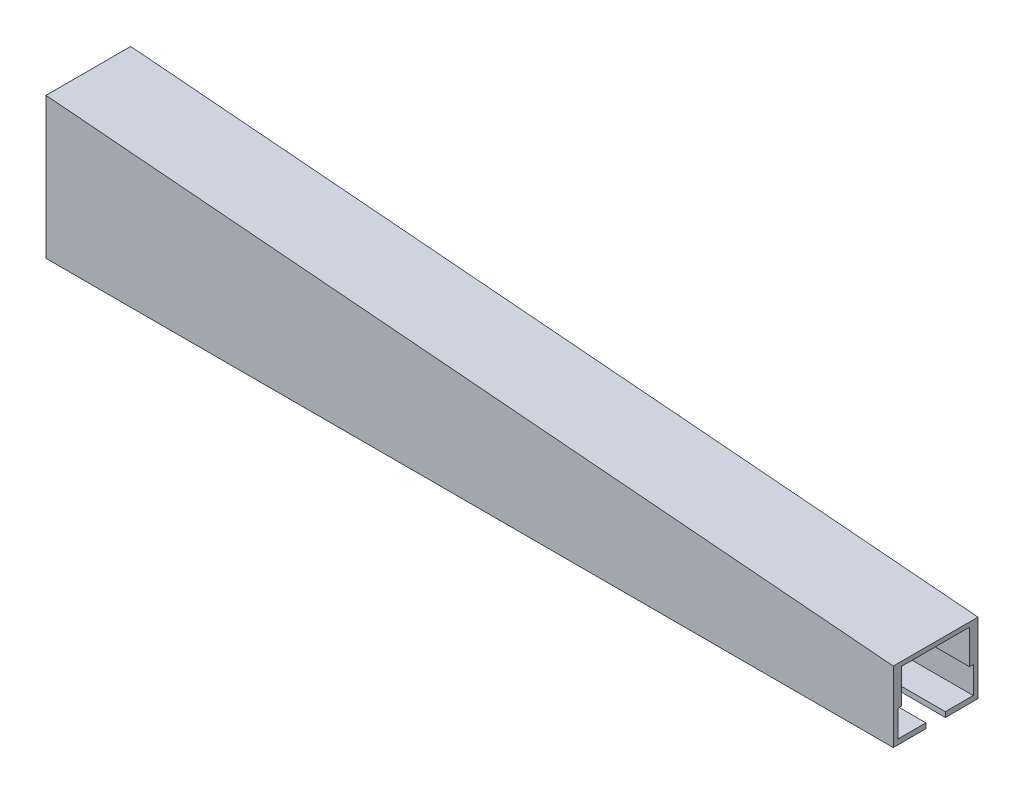
ISO-10303-21;
HEADER;
FILE_DESCRIPTION(('STEP AP214'),'2;1');
FILE_NAME('part.step','',(''),(''),'','','');
FILE_SCHEMA(('AUTOMOTIVE_DESIGN { 1 0 10303 214 1 1 1 1 }'));
ENDSEC;
DATA;
#1=APPLICATION_CONTEXT('core data for automotive mechanical design processes');
#2=APPLICATION_PROTOCOL_DEFINITION('international standard','automotive_design',2000,#1);
#3=PRODUCT_CONTEXT('',#1,'mechanical');
#4=PRODUCT('Part','Part','',(#3));
#5=PRODUCT_RELATED_PRODUCT_CATEGORY('part','',(#4));
#6=PRODUCT_DEFINITION_FORMATION('','',#4);
#7=PRODUCT_DEFINITION_CONTEXT('part definition',#1,'design');
#8=PRODUCT_DEFINITION('design','',#6,#7);
#9=PRODUCT_DEFINITION_SHAPE('','',#8);
#10=(LENGTH_UNIT() NAMED_UNIT(*) SI_UNIT(.MILLI.,.METRE.));
#11=(NAMED_UNIT(*) PLANE_ANGLE_UNIT() SI_UNIT($,.RADIAN.));
#12=(NAMED_UNIT(*) SI_UNIT($,.STERADIAN.) SOLID_ANGLE_UNIT());
#13=UNCERTAINTY_MEASURE_WITH_UNIT(LENGTH_MEASURE(1.E-05),#10,'distance_accuracy_value','');
#14=(GEOMETRIC_REPRESENTATION_CONTEXT(3) GLOBAL_UNCERTAINTY_ASSIGNED_CONTEXT((#13)) GLOBAL_UNIT_ASSIGNED_CONTEXT((#10,
#11,#12)) REPRESENTATION_CONTEXT('',''));
#15=CARTESIAN_POINT('',(0.,0.,0.));
#16=DIRECTION('',(0.,0.,1.));
#17=DIRECTION('',(1.,0.,0.));
#18=AXIS2_PLACEMENT_3D('',#15,#16,#17);
#19=CARTESIAN_POINT('',(0.,11.2975004120288,28.3233824548473));
#20=DIRECTION('',(0.,1.,0.));
#21=DIRECTION('',(0.,0.,1.));
#22=AXIS2_PLACEMENT_3D('',#19,#20,#21);
#23=PLANE('',#22);
#24=DIRECTION('',(-1.,0.,0.));
#25=VECTOR('',#24,1.);
#26=CARTESIAN_POINT('',(0.,11.2975004120288,27.));
#27=LINE('',#26,#25);
#28=CARTESIAN_POINT('',(300.,11.2975004120288,27.));
#29=VERTEX_POINT('',#28);
#30=CARTESIAN_POINT('',(0.,11.2975004120288,27.));
#31=VERTEX_POINT('',#30);
#32=EDGE_CURVE('E45',#29,#31,#27,.T.);
#33=ORIENTED_EDGE('',*,*,#32,.F.);
#34=DIRECTION('',(0.,0.,1.));
#35=VECTOR('',#34,1.);
#36=CARTESIAN_POINT('',(300.,11.2975004120288,28.3233824548473));
#37=LINE('',#36,#35);
#38=CARTESIAN_POINT('',(300.,11.2975004120288,28.3233824548473));
#39=VERTEX_POINT('',#38);
#40=EDGE_CURVE('E204',#29,#39,#37,.T.);
#41=ORIENTED_EDGE('',*,*,#40,.T.);
#42=DIRECTION('',(1.,0.,0.));
#43=VECTOR('',#42,1.);
#44=CARTESIAN_POINT('',(0.,11.2975004120288,28.3233824548473));
#45=LINE('',#44,#43);
#46=CARTESIAN_POINT('',(0.,11.2975004120288,28.3233824548473));
#47=VERTEX_POINT('',#46);
#48=EDGE_CURVE('E223',#47,#39,#45,.T.);
#49=ORIENTED_EDGE('',*,*,#48,.F.);
#50=DIRECTION('',(0.,0.,1.));
#51=VECTOR('',#50,1.);
#52=CARTESIAN_POINT('',(0.,11.2975004120288,28.3233824548473));
#53=LINE('',#52,#51);
#54=EDGE_CURVE('E187',#31,#47,#53,.T.);
#55=ORIENTED_EDGE('',*,*,#54,.F.);
#56=EDGE_LOOP('',(#33,#41,#49,#55));
#57=FACE_BOUND('',#56,.T.);
#58=ADVANCED_FACE('F37',(#57),#23,.F.);
#59=CARTESIAN_POINT('',(0.,0.,30.));
#60=DIRECTION('',(0.,1.,0.));
#61=DIRECTION('',(0.,0.,1.));
#62=AXIS2_PLACEMENT_3D('',#59,#60,#61);
#63=PLANE('',#62);
#64=DIRECTION('',(0.,0.,-1.));
#65=VECTOR('',#64,1.);
#66=CARTESIAN_POINT('',(0.,0.,30.));
#67=LINE('',#66,#65);
#68=CARTESIAN_POINT('',(0.,0.,30.));
#69=VERTEX_POINT('',#68);
#70=CARTESIAN_POINT('',(0.,0.,18.429564860976));
#71=VERTEX_POINT('',#70);
#72=EDGE_CURVE('E262',#69,#71,#67,.T.);
#73=ORIENTED_EDGE('',*,*,#72,.T.);
#74=DIRECTION('',(1.,0.,0.));
#75=VECTOR('',#74,1.);
#76=CARTESIAN_POINT('',(0.,0.,18.429564860976));
#77=LINE('',#76,#75);
#78=CARTESIAN_POINT('',(300.,0.,18.429564860976));
#79=VERTEX_POINT('',#78);
#80=EDGE_CURVE('E215',#71,#79,#77,.T.);
#81=ORIENTED_EDGE('',*,*,#80,.T.);
#82=DIRECTION('',(0.,0.,-1.));
#83=VECTOR('',#82,1.);
#84=CARTESIAN_POINT('',(300.,0.,30.));
#85=LINE('',#84,#83);
#86=CARTESIAN_POINT('',(300.,0.,30.));
#87=VERTEX_POINT('',#86);
#88=EDGE_CURVE('E258',#87,#79,#85,.T.);
#89=ORIENTED_EDGE('',*,*,#88,.F.);
#90=DIRECTION('',(1.,0.,0.));
#91=VECTOR('',#90,1.);
#92=CARTESIAN_POINT('',(0.,0.,30.));
#93=LINE('',#92,#91);
#94=EDGE_CURVE('E236',#69,#87,#93,.T.);
#95=ORIENTED_EDGE('',*,*,#94,.F.);
#96=EDGE_LOOP('',(#73,#81,#89,#95));
#97=FACE_BOUND('',#96,.T.);
#98=ADVANCED_FACE('F321',(#97),#63,.F.);
#99=CARTESIAN_POINT('',(0.,50.,30.));
#100=DIRECTION('',(1.,0.,0.));
#101=DIRECTION('',(0.,1.,0.));
#102=AXIS2_PLACEMENT_3D('',#99,#100,#101);
#103=PLANE('',#102);
#104=CARTESIAN_POINT('',(0.,11.2975004120288,1.67661754515275));
#105=VERTEX_POINT('',#104);
#106=CARTESIAN_POINT('',(0.,11.2975004120288,3.));
#107=VERTEX_POINT('',#106);
#108=EDGE_CURVE('E188',#105,#107,#53,.T.);
#109=ORIENTED_EDGE('',*,*,#108,.T.);
#110=DIRECTION('',(0.,1.,0.));
#111=VECTOR('',#110,1.);
#112=CARTESIAN_POINT('',(0.,7.80839748179973,3.));
#113=LINE('',#112,#111);
#114=CARTESIAN_POINT('',(0.,47.5500240823146,3.));
#115=VERTEX_POINT('',#114);
#116=EDGE_CURVE('E168',#107,#115,#113,.T.);
#117=ORIENTED_EDGE('',*,*,#116,.T.);
#118=DIRECTION('',(0.,0.,1.));
#119=VECTOR('',#118,1.);
#120=CARTESIAN_POINT('',(0.,47.5500240823146,3.));
#121=LINE('',#120,#119);
#122=CARTESIAN_POINT('',(0.,47.5500240823146,27.));
#123=VERTEX_POINT('',#122);
#124=EDGE_CURVE('E160',#115,#123,#121,.T.);
#125=ORIENTED_EDGE('',*,*,#124,.T.);
#126=DIRECTION('',(0.,1.,0.));
#127=VECTOR('',#126,1.);
#128=CARTESIAN_POINT('',(0.,7.80839748179973,27.));
#129=LINE('',#128,#127);
#130=EDGE_CURVE('E150',#31,#123,#129,.T.);
#131=ORIENTED_EDGE('',*,*,#130,.F.);
#132=ORIENTED_EDGE('',*,*,#54,.T.);
#133=DIRECTION('',(0.,-1.,0.));
#134=VECTOR('',#133,1.);
#135=CARTESIAN_POINT('',(0.,1.79768440375418,28.3233824548473));
#136=LINE('',#135,#134);
#137=CARTESIAN_POINT('',(0.,1.79768440375418,28.3233824548473));
#138=VERTEX_POINT('',#137);
#139=EDGE_CURVE('E190',#47,#138,#136,.T.);
#140=ORIENTED_EDGE('',*,*,#139,.T.);
#141=DIRECTION('',(0.,0.,-1.));
#142=VECTOR('',#141,1.);
#143=CARTESIAN_POINT('',(0.,1.79768440375418,18.429564860976));
#144=LINE('',#143,#142);
#145=CARTESIAN_POINT('',(0.,1.79768440375418,18.429564860976));
#146=VERTEX_POINT('',#145);
#147=EDGE_CURVE('E193',#138,#146,#144,.T.);
#148=ORIENTED_EDGE('',*,*,#147,.T.);
#149=DIRECTION('',(0.,-1.,0.));
#150=VECTOR('',#149,1.);
#151=CARTESIAN_POINT('',(0.,0.,18.429564860976));
#152=LINE('',#151,#150);
#153=EDGE_CURVE('E196',#146,#71,#152,.T.);
#154=ORIENTED_EDGE('',*,*,#153,.T.);
#155=ORIENTED_EDGE('',*,*,#72,.F.);
#156=DIRECTION('',(0.,-1.,0.));
#157=VECTOR('',#156,1.);
#158=CARTESIAN_POINT('',(0.,50.,30.));
#159=LINE('',#158,#157);
#160=CARTESIAN_POINT('',(0.,50.,30.));
#161=VERTEX_POINT('',#160);
#162=EDGE_CURVE('E233',#161,#69,#159,.T.);
#163=ORIENTED_EDGE('',*,*,#162,.F.);
#164=DIRECTION('',(0.,0.,-1.));
#165=VECTOR('',#164,1.);
#166=CARTESIAN_POINT('',(0.,50.,30.));
#167=LINE('',#166,#165);
#168=CARTESIAN_POINT('',(0.,50.,0.));
#169=VERTEX_POINT('',#168);
#170=EDGE_CURVE('E243',#161,#169,#167,.T.);
#171=ORIENTED_EDGE('',*,*,#170,.T.);
#172=DIRECTION('',(0.,-1.,0.));
#173=VECTOR('',#172,1.);
#174=CARTESIAN_POINT('',(0.,50.,0.));
#175=LINE('',#174,#173);
#176=CARTESIAN_POINT('',(0.,0.,0.));
#177=VERTEX_POINT('',#176);
#178=EDGE_CURVE('E218',#169,#177,#175,.T.);
#179=ORIENTED_EDGE('',*,*,#178,.T.);
#180=CARTESIAN_POINT('',(0.,0.,11.570435139024));
#181=VERTEX_POINT('',#180);
#182=EDGE_CURVE('E261',#181,#177,#67,.T.);
#183=ORIENTED_EDGE('',*,*,#182,.F.);
#184=DIRECTION('',(0.,1.,0.));
#185=VECTOR('',#184,1.);
#186=CARTESIAN_POINT('',(0.,0.,11.570435139024));
#187=LINE('',#186,#185);
#188=CARTESIAN_POINT('',(0.,1.79768440375418,11.570435139024));
#189=VERTEX_POINT('',#188);
#190=EDGE_CURVE('E177',#181,#189,#187,.T.);
#191=ORIENTED_EDGE('',*,*,#190,.T.);
#192=DIRECTION('',(0.,0.,-1.));
#193=VECTOR('',#192,1.);
#194=CARTESIAN_POINT('',(0.,1.79768440375418,11.570435139024));
#195=LINE('',#194,#193);
#196=CARTESIAN_POINT('',(0.,1.79768440375418,1.67661754515275));
#197=VERTEX_POINT('',#196);
#198=EDGE_CURVE('E180',#189,#197,#195,.T.);
#199=ORIENTED_EDGE('',*,*,#198,.T.);
#200=DIRECTION('',(0.,1.,0.));
#201=VECTOR('',#200,1.);
#202=CARTESIAN_POINT('',(0.,1.79768440375418,1.67661754515275));
#203=LINE('',#202,#201);
#204=EDGE_CURVE('E184',#197,#105,#203,.T.);
#205=ORIENTED_EDGE('',*,*,#204,.T.);
#206=EDGE_LOOP('',(#109,#117,#125,#131,#132,#140,#148,#154,#155,#163,#171,#179,#183,#191,#199,#205));
#207=FACE_BOUND('',#206,.T.);
#208=ADVANCED_FACE('F39',(#207),#103,.F.);
#209=CARTESIAN_POINT('',(300.,0.,11.570435139024));
#210=VERTEX_POINT('',#209);
#211=CARTESIAN_POINT('',(300.,0.,0.));
#212=VERTEX_POINT('',#211);
#213=EDGE_CURVE('E257',#210,#212,#85,.T.);
#214=ORIENTED_EDGE('',*,*,#213,.F.);
#215=DIRECTION('',(1.,0.,0.));
#216=VECTOR('',#215,1.);
#217=CARTESIAN_POINT('',(0.,0.,11.570435139024));
#218=LINE('',#217,#216);
#219=EDGE_CURVE('E60',#181,#210,#218,.T.);
#220=ORIENTED_EDGE('',*,*,#219,.F.);
#221=ORIENTED_EDGE('',*,*,#182,.T.);
#222=DIRECTION('',(1.,0.,0.));
#223=VECTOR('',#222,1.);
#224=CARTESIAN_POINT('',(0.,0.,0.));
#225=LINE('',#224,#223);
#226=EDGE_CURVE('E246',#177,#212,#225,.T.);
#227=ORIENTED_EDGE('',*,*,#226,.T.);
#228=EDGE_LOOP('',(#214,#220,#221,#227));
#229=FACE_BOUND('',#228,.T.);
#230=ADVANCED_FACE('F270',(#229),#63,.F.);
#231=CARTESIAN_POINT('',(300.,0.,30.));
#232=DIRECTION('',(-1.,0.,0.));
#233=DIRECTION('',(0.,0.,1.));
#234=AXIS2_PLACEMENT_3D('',#231,#232,#233);
#235=PLANE('',#234);
#236=DIRECTION('',(0.,0.,1.));
#237=VECTOR('',#236,1.);
#238=CARTESIAN_POINT('',(300.,23.4371270438,3.));
#239=LINE('',#238,#237);
#240=CARTESIAN_POINT('',(300.,23.4371270438,3.));
#241=VERTEX_POINT('',#240);
#242=CARTESIAN_POINT('',(300.,23.4371270438,27.));
#243=VERTEX_POINT('',#242);
#244=EDGE_CURVE('E163',#241,#243,#239,.T.);
#245=ORIENTED_EDGE('',*,*,#244,.F.);
#246=DIRECTION('',(0.,-1.,0.));
#247=VECTOR('',#246,1.);
#248=CARTESIAN_POINT('',(300.,23.4371270438,3.));
#249=LINE('',#248,#247);
#250=CARTESIAN_POINT('',(300.,11.2975004120288,3.));
#251=VERTEX_POINT('',#250);
#252=EDGE_CURVE('E164',#241,#251,#249,.T.);
#253=ORIENTED_EDGE('',*,*,#252,.T.);
#254=CARTESIAN_POINT('',(300.,11.2975004120288,1.67661754515275));
#255=VERTEX_POINT('',#254);
#256=EDGE_CURVE('E205',#255,#251,#37,.T.);
#257=ORIENTED_EDGE('',*,*,#256,.F.);
#258=DIRECTION('',(0.,1.,0.));
#259=VECTOR('',#258,1.);
#260=CARTESIAN_POINT('',(300.,1.79768440375418,1.67661754515275));
#261=LINE('',#260,#259);
#262=CARTESIAN_POINT('',(300.,1.79768440375418,1.67661754515275));
#263=VERTEX_POINT('',#262);
#264=EDGE_CURVE('E201',#263,#255,#261,.T.);
#265=ORIENTED_EDGE('',*,*,#264,.F.);
#266=DIRECTION('',(0.,0.,-1.));
#267=VECTOR('',#266,1.);
#268=CARTESIAN_POINT('',(300.,1.79768440375418,11.570435139024));
#269=LINE('',#268,#267);
#270=CARTESIAN_POINT('',(300.,1.79768440375418,11.570435139024));
#271=VERTEX_POINT('',#270);
#272=EDGE_CURVE('E171',#271,#263,#269,.T.);
#273=ORIENTED_EDGE('',*,*,#272,.F.);
#274=DIRECTION('',(0.,1.,0.));
#275=VECTOR('',#274,1.);
#276=CARTESIAN_POINT('',(300.,0.,11.570435139024));
#277=LINE('',#276,#275);
#278=EDGE_CURVE('E169',#210,#271,#277,.T.);
#279=ORIENTED_EDGE('',*,*,#278,.F.);
#280=ORIENTED_EDGE('',*,*,#213,.T.);
#281=DIRECTION('',(0.,1.,0.));
#282=VECTOR('',#281,1.);
#283=CARTESIAN_POINT('',(300.,0.,0.));
#284=LINE('',#283,#282);
#285=CARTESIAN_POINT('',(300.,25.,0.));
#286=VERTEX_POINT('',#285);
#287=EDGE_CURVE('E249',#212,#286,#284,.T.);
#288=ORIENTED_EDGE('',*,*,#287,.T.);
#289=DIRECTION('',(0.,0.,-1.));
#290=VECTOR('',#289,1.);
#291=CARTESIAN_POINT('',(300.,25.,30.));
#292=LINE('',#291,#290);
#293=CARTESIAN_POINT('',(300.,25.,30.));
#294=VERTEX_POINT('',#293);
#295=EDGE_CURVE('E254',#294,#286,#292,.T.);
#296=ORIENTED_EDGE('',*,*,#295,.F.);
#297=DIRECTION('',(0.,1.,0.));
#298=VECTOR('',#297,1.);
#299=CARTESIAN_POINT('',(300.,0.,30.));
#300=LINE('',#299,#298);
#301=EDGE_CURVE('E239',#87,#294,#300,.T.);
#302=ORIENTED_EDGE('',*,*,#301,.F.);
#303=ORIENTED_EDGE('',*,*,#88,.T.);
#304=DIRECTION('',(0.,-1.,0.));
#305=VECTOR('',#304,1.);
#306=CARTESIAN_POINT('',(300.,0.,18.429564860976));
#307=LINE('',#306,#305);
#308=CARTESIAN_POINT('',(300.,1.79768440375418,18.429564860976));
#309=VERTEX_POINT('',#308);
#310=EDGE_CURVE('E181',#309,#79,#307,.T.);
#311=ORIENTED_EDGE('',*,*,#310,.F.);
#312=DIRECTION('',(0.,0.,-1.));
#313=VECTOR('',#312,1.);
#314=CARTESIAN_POINT('',(300.,1.79768440375418,18.429564860976));
#315=LINE('',#314,#313);
#316=CARTESIAN_POINT('',(300.,1.79768440375418,28.3233824548473));
#317=VERTEX_POINT('',#316);
#318=EDGE_CURVE('E211',#317,#309,#315,.T.);
#319=ORIENTED_EDGE('',*,*,#318,.F.);
#320=DIRECTION('',(0.,-1.,0.));
#321=VECTOR('',#320,1.);
#322=CARTESIAN_POINT('',(300.,1.79768440375418,28.3233824548473));
#323=LINE('',#322,#321);
#324=EDGE_CURVE('E208',#39,#317,#323,.T.);
#325=ORIENTED_EDGE('',*,*,#324,.F.);
#326=ORIENTED_EDGE('',*,*,#40,.F.);
#327=DIRECTION('',(0.,-1.,0.));
#328=VECTOR('',#327,1.);
#329=CARTESIAN_POINT('',(300.,23.4371270438,27.));
#330=LINE('',#329,#328);
#331=EDGE_CURVE('E52',#243,#29,#330,.T.);
#332=ORIENTED_EDGE('',*,*,#331,.F.);
#333=EDGE_LOOP('',(#245,#253,#257,#265,#273,#279,#280,#288,#296,#302,#303,#311,#319,#325,#326,#332));
#334=FACE_BOUND('',#333,.T.);
#335=ADVANCED_FACE('F284',(#334),#235,.F.);
#336=CARTESIAN_POINT('',(300.,25.,30.));
#337=DIRECTION('',(-0.08304547985374,-0.99654575824488,0.));
#338=DIRECTION('',(0.99654575824488,-0.08304547985374,0.));
#339=AXIS2_PLACEMENT_3D('',#336,#337,#338);
#340=PLANE('',#339);
#341=DIRECTION('',(-0.99654575824488,0.08304547985374,0.));
#342=VECTOR('',#341,1.);
#343=CARTESIAN_POINT('',(300.,25.,0.));
#344=LINE('',#343,#342);
#345=EDGE_CURVE('E237',#286,#169,#344,.T.);
#346=ORIENTED_EDGE('',*,*,#345,.T.);
#347=ORIENTED_EDGE('',*,*,#170,.F.);
#348=DIRECTION('',(-0.99654575824488,0.08304547985374,0.));
#349=VECTOR('',#348,1.);
#350=CARTESIAN_POINT('',(300.,25.,30.));
#351=LINE('',#350,#349);
#352=EDGE_CURVE('E241',#294,#161,#351,.T.);
#353=ORIENTED_EDGE('',*,*,#352,.F.);
#354=ORIENTED_EDGE('',*,*,#295,.T.);
#355=EDGE_LOOP('',(#346,#347,#353,#354));
#356=FACE_BOUND('',#355,.T.);
#357=ADVANCED_FACE('F280',(#356),#340,.F.);
#358=CARTESIAN_POINT('',(0.,0.,30.));
#359=DIRECTION('',(0.,0.,1.));
#360=DIRECTION('',(1.,0.,0.));
#361=AXIS2_PLACEMENT_3D('',#358,#359,#360);
#362=PLANE('',#361);
#363=ORIENTED_EDGE('',*,*,#162,.T.);
#364=ORIENTED_EDGE('',*,*,#94,.T.);
#365=ORIENTED_EDGE('',*,*,#301,.T.);
#366=ORIENTED_EDGE('',*,*,#352,.T.);
#367=EDGE_LOOP('',(#363,#364,#365,#366));
#368=FACE_BOUND('',#367,.T.);
#369=ADVANCED_FACE('F323',(#368),#362,.T.);
#370=CARTESIAN_POINT('',(0.,0.,0.));
#371=DIRECTION('',(0.,0.,1.));
#372=DIRECTION('',(1.,0.,0.));
#373=AXIS2_PLACEMENT_3D('',#370,#371,#372);
#374=PLANE('',#373);
#375=ORIENTED_EDGE('',*,*,#178,.F.);
#376=ORIENTED_EDGE('',*,*,#345,.F.);
#377=ORIENTED_EDGE('',*,*,#287,.F.);
#378=ORIENTED_EDGE('',*,*,#226,.F.);
#379=EDGE_LOOP('',(#375,#376,#377,#378));
#380=FACE_BOUND('',#379,.T.);
#381=ADVANCED_FACE('F274',(#380),#374,.F.);
#382=CARTESIAN_POINT('',(0.,0.,18.429564860976));
#383=DIRECTION('',(0.,0.,1.));
#384=DIRECTION('',(1.,0.,0.));
#385=AXIS2_PLACEMENT_3D('',#382,#383,#384);
#386=PLANE('',#385);
#387=ORIENTED_EDGE('',*,*,#310,.T.);
#388=ORIENTED_EDGE('',*,*,#80,.F.);
#389=ORIENTED_EDGE('',*,*,#153,.F.);
#390=DIRECTION('',(1.,0.,0.));
#391=VECTOR('',#390,1.);
#392=CARTESIAN_POINT('',(0.,1.79768440375418,18.429564860976));
#393=LINE('',#392,#391);
#394=EDGE_CURVE('E219',#146,#309,#393,.T.);
#395=ORIENTED_EDGE('',*,*,#394,.T.);
#396=EDGE_LOOP('',(#387,#388,#389,#395));
#397=FACE_BOUND('',#396,.T.);
#398=ADVANCED_FACE('F319',(#397),#386,.F.);
#399=CARTESIAN_POINT('',(0.,1.79768440375418,18.429564860976));
#400=DIRECTION('',(0.,-1.,0.));
#401=DIRECTION('',(0.,0.,-1.));
#402=AXIS2_PLACEMENT_3D('',#399,#400,#401);
#403=PLANE('',#402);
#404=ORIENTED_EDGE('',*,*,#318,.T.);
#405=ORIENTED_EDGE('',*,*,#394,.F.);
#406=ORIENTED_EDGE('',*,*,#147,.F.);
#407=DIRECTION('',(1.,0.,0.));
#408=VECTOR('',#407,1.);
#409=CARTESIAN_POINT('',(0.,1.79768440375418,28.3233824548473));
#410=LINE('',#409,#408);
#411=EDGE_CURVE('E221',#138,#317,#410,.T.);
#412=ORIENTED_EDGE('',*,*,#411,.T.);
#413=EDGE_LOOP('',(#404,#405,#406,#412));
#414=FACE_BOUND('',#413,.T.);
#415=ADVANCED_FACE('F316',(#414),#403,.F.);
#416=CARTESIAN_POINT('',(0.,1.79768440375418,28.3233824548473));
#417=DIRECTION('',(0.,0.,1.));
#418=DIRECTION('',(1.,0.,0.));
#419=AXIS2_PLACEMENT_3D('',#416,#417,#418);
#420=PLANE('',#419);
#421=ORIENTED_EDGE('',*,*,#324,.T.);
#422=ORIENTED_EDGE('',*,*,#411,.F.);
#423=ORIENTED_EDGE('',*,*,#139,.F.);
#424=ORIENTED_EDGE('',*,*,#48,.T.);
#425=EDGE_LOOP('',(#421,#422,#423,#424));
#426=FACE_BOUND('',#425,.T.);
#427=ADVANCED_FACE('F312',(#426),#420,.F.);
#428=ORIENTED_EDGE('',*,*,#256,.T.);
#429=DIRECTION('',(-1.,0.,0.));
#430=VECTOR('',#429,1.);
#431=CARTESIAN_POINT('',(0.,11.2975004120288,3.));
#432=LINE('',#431,#430);
#433=EDGE_CURVE('E11',#251,#107,#432,.T.);
#434=ORIENTED_EDGE('',*,*,#433,.T.);
#435=ORIENTED_EDGE('',*,*,#108,.F.);
#436=DIRECTION('',(1.,0.,0.));
#437=VECTOR('',#436,1.);
#438=CARTESIAN_POINT('',(0.,11.2975004120288,1.67661754515275));
#439=LINE('',#438,#437);
#440=EDGE_CURVE('E226',#105,#255,#439,.T.);
#441=ORIENTED_EDGE('',*,*,#440,.T.);
#442=EDGE_LOOP('',(#428,#434,#435,#441));
#443=FACE_BOUND('',#442,.T.);
#444=ADVANCED_FACE('F297',(#443),#23,.F.);
#445=CARTESIAN_POINT('',(0.,1.79768440375418,1.67661754515275));
#446=DIRECTION('',(0.,0.,-1.));
#447=DIRECTION('',(-1.,0.,0.));
#448=AXIS2_PLACEMENT_3D('',#445,#446,#447);
#449=PLANE('',#448);
#450=ORIENTED_EDGE('',*,*,#264,.T.);
#451=ORIENTED_EDGE('',*,*,#440,.F.);
#452=ORIENTED_EDGE('',*,*,#204,.F.);
#453=DIRECTION('',(1.,0.,0.));
#454=VECTOR('',#453,1.);
#455=CARTESIAN_POINT('',(0.,1.79768440375418,1.67661754515275));
#456=LINE('',#455,#454);
#457=EDGE_CURVE('E228',#197,#263,#456,.T.);
#458=ORIENTED_EDGE('',*,*,#457,.T.);
#459=EDGE_LOOP('',(#450,#451,#452,#458));
#460=FACE_BOUND('',#459,.T.);
#461=ADVANCED_FACE('F294',(#460),#449,.F.);
#462=CARTESIAN_POINT('',(0.,1.79768440375418,11.570435139024));
#463=DIRECTION('',(0.,-1.,0.));
#464=DIRECTION('',(0.,0.,-1.));
#465=AXIS2_PLACEMENT_3D('',#462,#463,#464);
#466=PLANE('',#465);
#467=ORIENTED_EDGE('',*,*,#272,.T.);
#468=ORIENTED_EDGE('',*,*,#457,.F.);
#469=ORIENTED_EDGE('',*,*,#198,.F.);
#470=DIRECTION('',(1.,0.,0.));
#471=VECTOR('',#470,1.);
#472=CARTESIAN_POINT('',(0.,1.79768440375418,11.570435139024));
#473=LINE('',#472,#471);
#474=EDGE_CURVE('E230',#189,#271,#473,.T.);
#475=ORIENTED_EDGE('',*,*,#474,.T.);
#476=EDGE_LOOP('',(#467,#468,#469,#475));
#477=FACE_BOUND('',#476,.T.);
#478=ADVANCED_FACE('F290',(#477),#466,.F.);
#479=CARTESIAN_POINT('',(0.,0.,11.570435139024));
#480=DIRECTION('',(0.,0.,-1.));
#481=DIRECTION('',(-1.,0.,0.));
#482=AXIS2_PLACEMENT_3D('',#479,#480,#481);
#483=PLANE('',#482);
#484=ORIENTED_EDGE('',*,*,#278,.T.);
#485=ORIENTED_EDGE('',*,*,#474,.F.);
#486=ORIENTED_EDGE('',*,*,#190,.F.);
#487=ORIENTED_EDGE('',*,*,#219,.T.);
#488=EDGE_LOOP('',(#484,#485,#486,#487));
#489=FACE_BOUND('',#488,.T.);
#490=ADVANCED_FACE('F287',(#489),#483,.F.);
#491=CARTESIAN_POINT('',(0.,0.,3.));
#492=DIRECTION('',(0.,0.,-1.));
#493=DIRECTION('',(-1.,0.,0.));
#494=AXIS2_PLACEMENT_3D('',#491,#492,#493);
#495=PLANE('',#494);
#496=ORIENTED_EDGE('',*,*,#252,.F.);
#497=DIRECTION('',(0.996785390589585,-0.0801179449759409,0.));
#498=VECTOR('',#497,1.);
#499=CARTESIAN_POINT('',(0.,47.5500240823146,3.));
#500=LINE('',#499,#498);
#501=EDGE_CURVE('E173',#115,#241,#500,.T.);
#502=ORIENTED_EDGE('',*,*,#501,.F.);
#503=ORIENTED_EDGE('',*,*,#116,.F.);
#504=ORIENTED_EDGE('',*,*,#433,.F.);
#505=EDGE_LOOP('',(#496,#502,#503,#504));
#506=FACE_BOUND('',#505,.T.);
#507=ADVANCED_FACE('F301',(#506),#495,.F.);
#508=CARTESIAN_POINT('',(0.,0.,27.));
#509=DIRECTION('',(0.,0.,-1.));
#510=DIRECTION('',(-1.,0.,0.));
#511=AXIS2_PLACEMENT_3D('',#508,#509,#510);
#512=PLANE('',#511);
#513=ORIENTED_EDGE('',*,*,#32,.T.);
#514=ORIENTED_EDGE('',*,*,#130,.T.);
#515=DIRECTION('',(0.996785390589585,-0.0801179449759409,0.));
#516=VECTOR('',#515,1.);
#517=CARTESIAN_POINT('',(0.,47.5500240823146,27.));
#518=LINE('',#517,#516);
#519=EDGE_CURVE('E153',#123,#243,#518,.T.);
#520=ORIENTED_EDGE('',*,*,#519,.T.);
#521=ORIENTED_EDGE('',*,*,#331,.T.);
#522=EDGE_LOOP('',(#513,#514,#520,#521));
#523=FACE_BOUND('',#522,.T.);
#524=ADVANCED_FACE('F152',(#523),#512,.T.);
#525=CARTESIAN_POINT('',(0.,47.5500240823146,3.));
#526=DIRECTION('',(-0.0801179449759409,-0.996785390589585,0.));
#527=DIRECTION('',(0.996785390589585,-0.0801179449759409,0.));
#528=AXIS2_PLACEMENT_3D('',#525,#526,#527);
#529=PLANE('',#528);
#530=ORIENTED_EDGE('',*,*,#124,.F.);
#531=ORIENTED_EDGE('',*,*,#501,.T.);
#532=ORIENTED_EDGE('',*,*,#244,.T.);
#533=ORIENTED_EDGE('',*,*,#519,.F.);
#534=EDGE_LOOP('',(#530,#531,#532,#533));
#535=FACE_BOUND('',#534,.T.);
#536=ADVANCED_FACE('F159',(#535),#529,.T.);
#537=CLOSED_SHELL('',(#58,#98,#208,#230,#335,#357,#369,#381,#398,#415,#427,#444,#461,#478,#490,
#507,#524,#536));
#538=MANIFOLD_SOLID_BREP('B2',#537);
#539=ADVANCED_BREP_SHAPE_REPRESENTATION('',(#18,#538),#14);
#540=SHAPE_DEFINITION_REPRESENTATION(#9,#539);
ENDSEC;
END-ISO-10303-21;
